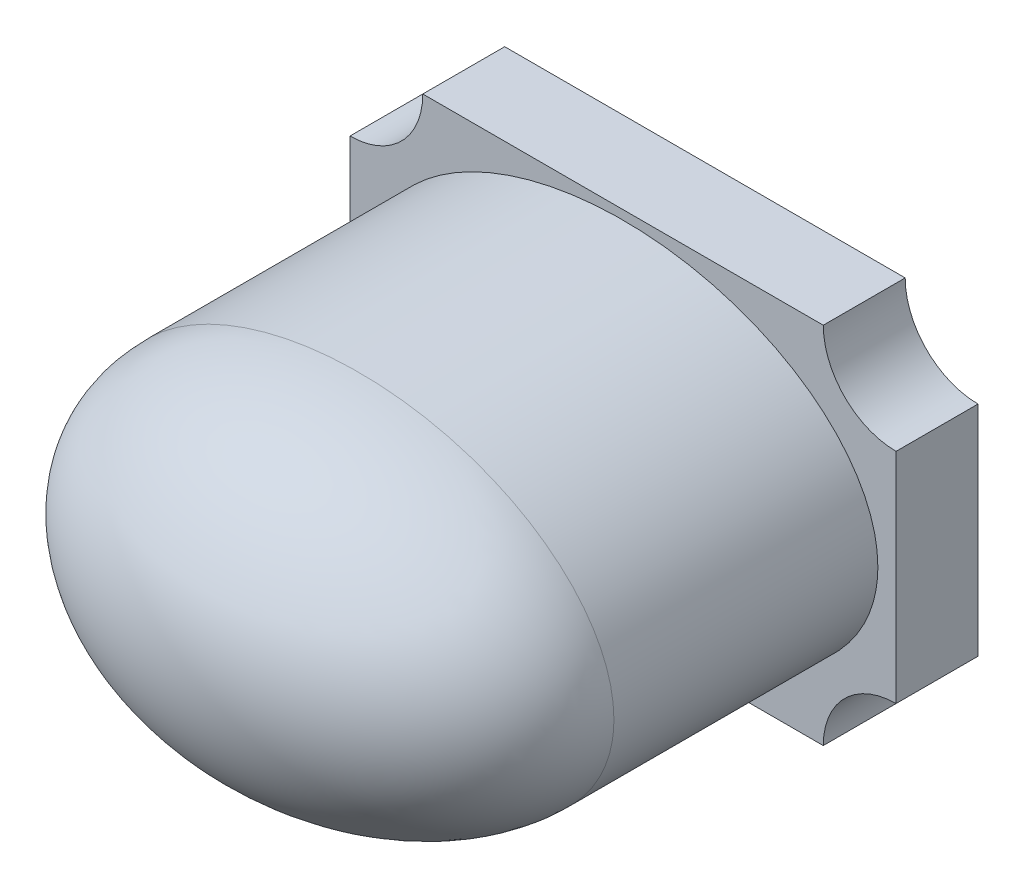
ISO-10303-21;
HEADER;
FILE_DESCRIPTION(('STEP AP214'),'2;1');
FILE_NAME('part.step','',(''),(''),'','','');
FILE_SCHEMA(('AUTOMOTIVE_DESIGN { 1 0 10303 214 1 1 1 1 }'));
ENDSEC;
DATA;
#1=APPLICATION_CONTEXT('core data for automotive mechanical design processes');
#2=APPLICATION_PROTOCOL_DEFINITION('international standard','automotive_design',2000,#1);
#3=PRODUCT_CONTEXT('',#1,'mechanical');
#4=PRODUCT('Part','Part','',(#3));
#5=PRODUCT_RELATED_PRODUCT_CATEGORY('part','',(#4));
#6=PRODUCT_DEFINITION_FORMATION('','',#4);
#7=PRODUCT_DEFINITION_CONTEXT('part definition',#1,'design');
#8=PRODUCT_DEFINITION('design','',#6,#7);
#9=PRODUCT_DEFINITION_SHAPE('','',#8);
#10=(LENGTH_UNIT() NAMED_UNIT(*) SI_UNIT(.MILLI.,.METRE.));
#11=(NAMED_UNIT(*) PLANE_ANGLE_UNIT() SI_UNIT($,.RADIAN.));
#12=(NAMED_UNIT(*) SI_UNIT($,.STERADIAN.) SOLID_ANGLE_UNIT());
#13=UNCERTAINTY_MEASURE_WITH_UNIT(LENGTH_MEASURE(1.E-05),#10,'distance_accuracy_value','');
#14=(GEOMETRIC_REPRESENTATION_CONTEXT(3) GLOBAL_UNCERTAINTY_ASSIGNED_CONTEXT((#13)) GLOBAL_UNIT_ASSIGNED_CONTEXT((#10,
#11,#12)) REPRESENTATION_CONTEXT('',''));
#15=CARTESIAN_POINT('',(0.,0.,0.));
#16=DIRECTION('',(0.,0.,1.));
#17=DIRECTION('',(1.,0.,0.));
#18=AXIS2_PLACEMENT_3D('',#15,#16,#17);
#19=CARTESIAN_POINT('',(1.5,0.,0.45));
#20=DIRECTION('',(1.,0.,0.));
#21=DIRECTION('',(0.,1.,0.));
#22=AXIS2_PLACEMENT_3D('',#19,#20,#21);
#23=PLANE('',#22);
#24=DIRECTION('',(0.,-1.,0.));
#25=VECTOR('',#24,1.);
#26=CARTESIAN_POINT('',(1.5,0.,0.));
#27=LINE('',#26,#25);
#28=CARTESIAN_POINT('',(1.5,0.600000000000001,0.));
#29=VERTEX_POINT('',#28);
#30=CARTESIAN_POINT('',(1.5,-0.600000000000001,0.));
#31=VERTEX_POINT('',#30);
#32=EDGE_CURVE('E138',#29,#31,#27,.T.);
#33=ORIENTED_EDGE('',*,*,#32,.F.);
#34=DIRECTION('',(0.,0.,-1.));
#35=VECTOR('',#34,1.);
#36=CARTESIAN_POINT('',(1.5,0.600000000000001,0.45));
#37=LINE('',#36,#35);
#38=CARTESIAN_POINT('',(1.5,0.600000000000001,0.45));
#39=VERTEX_POINT('',#38);
#40=EDGE_CURVE('E11',#39,#29,#37,.T.);
#41=ORIENTED_EDGE('',*,*,#40,.F.);
#42=DIRECTION('',(0.,-1.,0.));
#43=VECTOR('',#42,1.);
#44=CARTESIAN_POINT('',(1.5,0.,0.45));
#45=LINE('',#44,#43);
#46=CARTESIAN_POINT('',(1.5,-0.600000000000001,0.45));
#47=VERTEX_POINT('',#46);
#48=EDGE_CURVE('E157',#39,#47,#45,.T.);
#49=ORIENTED_EDGE('',*,*,#48,.T.);
#50=DIRECTION('',(0.,0.,-1.));
#51=VECTOR('',#50,1.);
#52=CARTESIAN_POINT('',(1.5,-0.600000000000001,0.45));
#53=LINE('',#52,#51);
#54=EDGE_CURVE('E91',#47,#31,#53,.T.);
#55=ORIENTED_EDGE('',*,*,#54,.T.);
#56=EDGE_LOOP('',(#33,#41,#49,#55));
#57=FACE_BOUND('',#56,.T.);
#58=ADVANCED_FACE('F37',(#57),#23,.T.);
#59=CARTESIAN_POINT('',(1.5,1.,0.45));
#60=DIRECTION('',(0.,0.,-1.));
#61=DIRECTION('',(-1.,0.,0.));
#62=AXIS2_PLACEMENT_3D('',#59,#60,#61);
#63=CYLINDRICAL_SURFACE('',#62,0.4);
#64=CARTESIAN_POINT('',(1.5,1.,0.));
#65=DIRECTION('',(0.,0.,1.));
#66=DIRECTION('',(1.,0.,0.));
#67=AXIS2_PLACEMENT_3D('',#64,#65,#66);
#68=CIRCLE('',#67,0.4);
#69=CARTESIAN_POINT('',(1.1,1.,0.));
#70=VERTEX_POINT('',#69);
#71=EDGE_CURVE('E141',#29,#70,#68,.F.);
#72=ORIENTED_EDGE('',*,*,#71,.T.);
#73=DIRECTION('',(0.,0.,-1.));
#74=VECTOR('',#73,1.);
#75=CARTESIAN_POINT('',(1.1,1.,0.45));
#76=LINE('',#75,#74);
#77=CARTESIAN_POINT('',(1.1,1.,0.45));
#78=VERTEX_POINT('',#77);
#79=EDGE_CURVE('E48',#78,#70,#76,.T.);
#80=ORIENTED_EDGE('',*,*,#79,.F.);
#81=CARTESIAN_POINT('',(1.5,1.,0.45));
#82=DIRECTION('',(0.,0.,1.));
#83=DIRECTION('',(1.,0.,0.));
#84=AXIS2_PLACEMENT_3D('',#81,#82,#83);
#85=CIRCLE('',#84,0.4);
#86=EDGE_CURVE('E184',#39,#78,#85,.F.);
#87=ORIENTED_EDGE('',*,*,#86,.F.);
#88=ORIENTED_EDGE('',*,*,#40,.T.);
#89=EDGE_LOOP('',(#72,#80,#87,#88));
#90=FACE_BOUND('',#89,.T.);
#91=ADVANCED_FACE('F218',(#90),#63,.F.);
#92=CARTESIAN_POINT('',(0.,1.,0.45));
#93=DIRECTION('',(0.,-1.,0.));
#94=DIRECTION('',(0.,0.,-1.));
#95=AXIS2_PLACEMENT_3D('',#92,#93,#94);
#96=PLANE('',#95);
#97=DIRECTION('',(-1.,0.,0.));
#98=VECTOR('',#97,1.);
#99=CARTESIAN_POINT('',(0.,1.,0.));
#100=LINE('',#99,#98);
#101=CARTESIAN_POINT('',(-1.1,1.,0.));
#102=VERTEX_POINT('',#101);
#103=EDGE_CURVE('E144',#70,#102,#100,.T.);
#104=ORIENTED_EDGE('',*,*,#103,.T.);
#105=DIRECTION('',(0.,0.,-1.));
#106=VECTOR('',#105,1.);
#107=CARTESIAN_POINT('',(-1.1,1.,0.45));
#108=LINE('',#107,#106);
#109=CARTESIAN_POINT('',(-1.1,1.,0.45));
#110=VERTEX_POINT('',#109);
#111=EDGE_CURVE('E163',#110,#102,#108,.T.);
#112=ORIENTED_EDGE('',*,*,#111,.F.);
#113=DIRECTION('',(-1.,0.,0.));
#114=VECTOR('',#113,1.);
#115=CARTESIAN_POINT('',(0.,1.,0.45));
#116=LINE('',#115,#114);
#117=EDGE_CURVE('E172',#78,#110,#116,.T.);
#118=ORIENTED_EDGE('',*,*,#117,.F.);
#119=ORIENTED_EDGE('',*,*,#79,.T.);
#120=EDGE_LOOP('',(#104,#112,#118,#119));
#121=FACE_BOUND('',#120,.T.);
#122=ADVANCED_FACE('F170',(#121),#96,.F.);
#123=CARTESIAN_POINT('',(-1.5,1.,0.45));
#124=DIRECTION('',(0.,0.,-1.));
#125=DIRECTION('',(-1.,0.,0.));
#126=AXIS2_PLACEMENT_3D('',#123,#124,#125);
#127=CYLINDRICAL_SURFACE('',#126,0.4);
#128=CARTESIAN_POINT('',(-1.5,1.,0.));
#129=DIRECTION('',(0.,0.,1.));
#130=DIRECTION('',(1.,0.,0.));
#131=AXIS2_PLACEMENT_3D('',#128,#129,#130);
#132=CIRCLE('',#131,0.4);
#133=CARTESIAN_POINT('',(-1.5,0.600000000000001,0.));
#134=VERTEX_POINT('',#133);
#135=EDGE_CURVE('E147',#134,#102,#132,.T.);
#136=ORIENTED_EDGE('',*,*,#135,.F.);
#137=DIRECTION('',(0.,0.,-1.));
#138=VECTOR('',#137,1.);
#139=CARTESIAN_POINT('',(-1.5,0.600000000000001,0.45));
#140=LINE('',#139,#138);
#141=CARTESIAN_POINT('',(-1.5,0.600000000000001,0.45));
#142=VERTEX_POINT('',#141);
#143=EDGE_CURVE('E161',#142,#134,#140,.T.);
#144=ORIENTED_EDGE('',*,*,#143,.F.);
#145=CARTESIAN_POINT('',(-1.5,1.,0.45));
#146=DIRECTION('',(0.,0.,1.));
#147=DIRECTION('',(1.,0.,0.));
#148=AXIS2_PLACEMENT_3D('',#145,#146,#147);
#149=CIRCLE('',#148,0.4);
#150=EDGE_CURVE('E182',#142,#110,#149,.T.);
#151=ORIENTED_EDGE('',*,*,#150,.T.);
#152=ORIENTED_EDGE('',*,*,#111,.T.);
#153=EDGE_LOOP('',(#136,#144,#151,#152));
#154=FACE_BOUND('',#153,.T.);
#155=ADVANCED_FACE('F180',(#154),#127,.F.);
#156=CARTESIAN_POINT('',(-1.5,0.,0.45));
#157=DIRECTION('',(1.,0.,0.));
#158=DIRECTION('',(0.,1.,0.));
#159=AXIS2_PLACEMENT_3D('',#156,#157,#158);
#160=PLANE('',#159);
#161=DIRECTION('',(0.,-1.,0.));
#162=VECTOR('',#161,1.);
#163=CARTESIAN_POINT('',(-1.5,0.,0.));
#164=LINE('',#163,#162);
#165=CARTESIAN_POINT('',(-1.5,-0.6,0.));
#166=VERTEX_POINT('',#165);
#167=EDGE_CURVE('E150',#134,#166,#164,.T.);
#168=ORIENTED_EDGE('',*,*,#167,.T.);
#169=DIRECTION('',(0.,0.,-1.));
#170=VECTOR('',#169,1.);
#171=CARTESIAN_POINT('',(-1.5,-0.6,0.45));
#172=LINE('',#171,#170);
#173=CARTESIAN_POINT('',(-1.5,-0.6,0.45));
#174=VERTEX_POINT('',#173);
#175=EDGE_CURVE('E130',#174,#166,#172,.T.);
#176=ORIENTED_EDGE('',*,*,#175,.F.);
#177=DIRECTION('',(0.,-1.,0.));
#178=VECTOR('',#177,1.);
#179=CARTESIAN_POINT('',(-1.5,0.,0.45));
#180=LINE('',#179,#178);
#181=EDGE_CURVE('E117',#142,#174,#180,.T.);
#182=ORIENTED_EDGE('',*,*,#181,.F.);
#183=ORIENTED_EDGE('',*,*,#143,.T.);
#184=EDGE_LOOP('',(#168,#176,#182,#183));
#185=FACE_BOUND('',#184,.T.);
#186=ADVANCED_FACE('F210',(#185),#160,.F.);
#187=CARTESIAN_POINT('',(-1.5,-1.,0.45));
#188=DIRECTION('',(0.,0.,-1.));
#189=DIRECTION('',(-1.,0.,0.));
#190=AXIS2_PLACEMENT_3D('',#187,#188,#189);
#191=CYLINDRICAL_SURFACE('',#190,0.4);
#192=CARTESIAN_POINT('',(-1.5,-1.,0.));
#193=DIRECTION('',(0.,0.,1.));
#194=DIRECTION('',(1.,0.,0.));
#195=AXIS2_PLACEMENT_3D('',#192,#193,#194);
#196=CIRCLE('',#195,0.4);
#197=CARTESIAN_POINT('',(-1.1,-1.,0.));
#198=VERTEX_POINT('',#197);
#199=EDGE_CURVE('E126',#166,#198,#196,.F.);
#200=ORIENTED_EDGE('',*,*,#199,.T.);
#201=DIRECTION('',(0.,0.,-1.));
#202=VECTOR('',#201,1.);
#203=CARTESIAN_POINT('',(-1.1,-1.,0.45));
#204=LINE('',#203,#202);
#205=CARTESIAN_POINT('',(-1.1,-1.,0.45));
#206=VERTEX_POINT('',#205);
#207=EDGE_CURVE('E123',#206,#198,#204,.T.);
#208=ORIENTED_EDGE('',*,*,#207,.F.);
#209=CARTESIAN_POINT('',(-1.5,-1.,0.45));
#210=DIRECTION('',(0.,0.,1.));
#211=DIRECTION('',(1.,0.,0.));
#212=AXIS2_PLACEMENT_3D('',#209,#210,#211);
#213=CIRCLE('',#212,0.4);
#214=EDGE_CURVE('E110',#174,#206,#213,.F.);
#215=ORIENTED_EDGE('',*,*,#214,.F.);
#216=ORIENTED_EDGE('',*,*,#175,.T.);
#217=EDGE_LOOP('',(#200,#208,#215,#216));
#218=FACE_BOUND('',#217,.T.);
#219=ADVANCED_FACE('F124',(#218),#191,.F.);
#220=CARTESIAN_POINT('',(0.,-1.,0.45));
#221=DIRECTION('',(0.,-1.,0.));
#222=DIRECTION('',(0.,0.,-1.));
#223=AXIS2_PLACEMENT_3D('',#220,#221,#222);
#224=PLANE('',#223);
#225=DIRECTION('',(-1.,0.,0.));
#226=VECTOR('',#225,1.);
#227=CARTESIAN_POINT('',(0.,-1.,0.));
#228=LINE('',#227,#226);
#229=CARTESIAN_POINT('',(1.1,-1.,0.));
#230=VERTEX_POINT('',#229);
#231=EDGE_CURVE('E153',#230,#198,#228,.T.);
#232=ORIENTED_EDGE('',*,*,#231,.F.);
#233=DIRECTION('',(0.,0.,-1.));
#234=VECTOR('',#233,1.);
#235=CARTESIAN_POINT('',(1.1,-1.,0.45));
#236=LINE('',#235,#234);
#237=CARTESIAN_POINT('',(1.1,-1.,0.45));
#238=VERTEX_POINT('',#237);
#239=EDGE_CURVE('E131',#238,#230,#236,.T.);
#240=ORIENTED_EDGE('',*,*,#239,.F.);
#241=DIRECTION('',(-1.,0.,0.));
#242=VECTOR('',#241,1.);
#243=CARTESIAN_POINT('',(0.,-1.,0.45));
#244=LINE('',#243,#242);
#245=EDGE_CURVE('E114',#238,#206,#244,.T.);
#246=ORIENTED_EDGE('',*,*,#245,.T.);
#247=ORIENTED_EDGE('',*,*,#207,.T.);
#248=EDGE_LOOP('',(#232,#240,#246,#247));
#249=FACE_BOUND('',#248,.T.);
#250=ADVANCED_FACE('F133',(#249),#224,.T.);
#251=CARTESIAN_POINT('',(1.5,-1.,0.45));
#252=DIRECTION('',(0.,0.,-1.));
#253=DIRECTION('',(-1.,0.,0.));
#254=AXIS2_PLACEMENT_3D('',#251,#252,#253);
#255=CYLINDRICAL_SURFACE('',#254,0.4);
#256=CARTESIAN_POINT('',(1.5,-1.,0.));
#257=DIRECTION('',(0.,0.,1.));
#258=DIRECTION('',(1.,0.,0.));
#259=AXIS2_PLACEMENT_3D('',#256,#257,#258);
#260=CIRCLE('',#259,0.4);
#261=EDGE_CURVE('E155',#230,#31,#260,.F.);
#262=ORIENTED_EDGE('',*,*,#261,.T.);
#263=ORIENTED_EDGE('',*,*,#54,.F.);
#264=CARTESIAN_POINT('',(1.5,-1.,0.45));
#265=DIRECTION('',(0.,0.,1.));
#266=DIRECTION('',(1.,0.,0.));
#267=AXIS2_PLACEMENT_3D('',#264,#265,#266);
#268=CIRCLE('',#267,0.4);
#269=EDGE_CURVE('E59',#238,#47,#268,.F.);
#270=ORIENTED_EDGE('',*,*,#269,.F.);
#271=ORIENTED_EDGE('',*,*,#239,.T.);
#272=EDGE_LOOP('',(#262,#263,#270,#271));
#273=FACE_BOUND('',#272,.T.);
#274=ADVANCED_FACE('F199',(#273),#255,.F.);
#275=CARTESIAN_POINT('',(0.,0.,0.45));
#276=DIRECTION('',(0.,0.,1.));
#277=DIRECTION('',(1.,0.,0.));
#278=AXIS2_PLACEMENT_3D('',#275,#276,#277);
#279=PLANE('',#278);
#280=CARTESIAN_POINT('',(0.,0.,0.45));
#281=DIRECTION('',(0.,0.,1.));
#282=DIRECTION('',(1.,0.,0.));
#283=AXIS2_PLACEMENT_3D('',#280,#281,#282);
#284=ELLIPSE('',#283,1.4,0.95);
#285=CARTESIAN_POINT('',(1.4,0.,0.45));
#286=VERTEX_POINT('',#285);
#287=EDGE_CURVE('E142',#286,#286,#284,.F.);
#288=ORIENTED_EDGE('',*,*,#287,.T.);
#289=EDGE_LOOP('',(#288));
#290=FACE_BOUND('',#289,.T.);
#291=ORIENTED_EDGE('',*,*,#48,.F.);
#292=ORIENTED_EDGE('',*,*,#86,.T.);
#293=ORIENTED_EDGE('',*,*,#117,.T.);
#294=ORIENTED_EDGE('',*,*,#150,.F.);
#295=ORIENTED_EDGE('',*,*,#181,.T.);
#296=ORIENTED_EDGE('',*,*,#214,.T.);
#297=ORIENTED_EDGE('',*,*,#245,.F.);
#298=ORIENTED_EDGE('',*,*,#269,.T.);
#299=EDGE_LOOP('',(#291,#292,#293,#294,#295,#296,#297,#298));
#300=FACE_BOUND('',#299,.T.);
#301=ADVANCED_FACE('F112',(#290,#300),#279,.T.);
#302=CARTESIAN_POINT('',(0.,0.,0.));
#303=DIRECTION('',(0.,0.,1.));
#304=DIRECTION('',(1.,0.,0.));
#305=AXIS2_PLACEMENT_3D('',#302,#303,#304);
#306=PLANE('',#305);
#307=ORIENTED_EDGE('',*,*,#32,.T.);
#308=ORIENTED_EDGE('',*,*,#261,.F.);
#309=ORIENTED_EDGE('',*,*,#231,.T.);
#310=ORIENTED_EDGE('',*,*,#199,.F.);
#311=ORIENTED_EDGE('',*,*,#167,.F.);
#312=ORIENTED_EDGE('',*,*,#135,.T.);
#313=ORIENTED_EDGE('',*,*,#103,.F.);
#314=ORIENTED_EDGE('',*,*,#71,.F.);
#315=EDGE_LOOP('',(#307,#308,#309,#310,#311,#312,#313,#314));
#316=FACE_BOUND('',#315,.T.);
#317=ADVANCED_FACE('F176',(#316),#306,.F.);
#318=CARTESIAN_POINT('',(0.,0.,1.9));
#319=DIRECTION('',(0.,0.,1.));
#320=DIRECTION('',(1.,0.,0.));
#321=AXIS2_PLACEMENT_3D('',#318,#319,#320);
#322=ELLIPSE('',#321,1.4,0.95);
#323=DIRECTION('',(0.,0.,-1.));
#324=VECTOR('',#323,1.);
#325=SURFACE_OF_LINEAR_EXTRUSION('',#322,#324);
#326=ORIENTED_EDGE('',*,*,#287,.F.);
#327=EDGE_LOOP('',(#326));
#328=FACE_BOUND('',#327,.T.);
#329=CARTESIAN_POINT('',(0.,0.,1.9));
#330=DIRECTION('',(0.,0.,1.));
#331=DIRECTION('',(1.,0.,0.));
#332=AXIS2_PLACEMENT_3D('',#329,#330,#331);
#333=ELLIPSE('',#332,1.4,0.95);
#334=CARTESIAN_POINT('',(1.4,0.,1.9));
#335=VERTEX_POINT('',#334);
#336=EDGE_CURVE('E43',#335,#335,#333,.T.);
#337=ORIENTED_EDGE('',*,*,#336,.F.);
#338=EDGE_LOOP('',(#337));
#339=FACE_BOUND('',#338,.T.);
#340=ADVANCED_FACE('F193',(#328,#339),#325,.F.);
#341=CARTESIAN_POINT('',(1.4,0.,1.9));
#342=CARTESIAN_POINT('',(1.4,0.,2.9));
#343=CARTESIAN_POINT('',(0.,0.,2.9));
#344=CARTESIAN_POINT('',(1.4,1.9,1.9));
#345=CARTESIAN_POINT('',(1.4,1.9,2.9));
#346=CARTESIAN_POINT('',(0.,0.,2.9));
#347=CARTESIAN_POINT('',(-1.4,1.9,1.9));
#348=CARTESIAN_POINT('',(-1.4,1.9,2.9));
#349=CARTESIAN_POINT('',(0.,0.,2.9));
#350=CARTESIAN_POINT('',(-1.4,0.,1.9));
#351=CARTESIAN_POINT('',(-1.4,0.,2.9));
#352=CARTESIAN_POINT('',(0.,0.,2.9));
#353=CARTESIAN_POINT('',(-1.4,-1.9,1.9));
#354=CARTESIAN_POINT('',(-1.4,-1.9,2.9));
#355=CARTESIAN_POINT('',(0.,0.,2.9));
#356=CARTESIAN_POINT('',(1.4,-1.9,1.9));
#357=CARTESIAN_POINT('',(1.4,-1.9,2.9));
#358=CARTESIAN_POINT('',(0.,0.,2.9));
#359=CARTESIAN_POINT('',(1.4,0.,1.9));
#360=CARTESIAN_POINT('',(1.4,0.,2.9));
#361=CARTESIAN_POINT('',(0.,0.,2.9));
#362=(BOUNDED_SURFACE() B_SPLINE_SURFACE(3,2,((#341,#342,#343),(#344,#345,#346),(#347,#348,
#349),(#350,#351,#352),(#353,#354,#355),(#356,#357,#358),(#359,#360,#361)),.UNSPECIFIED.,.T.,
.F.,.F.) B_SPLINE_SURFACE_WITH_KNOTS((4,3,4),(3,3),(0.,0.5,1.),(0.,1.),
.UNSPECIFIED.) GEOMETRIC_REPRESENTATION_ITEM() RATIONAL_B_SPLINE_SURFACE(((1.,0.707106781186548,
1.),(0.333333333333333,0.235702260395516,0.333333333333333),(0.333333333333333,
0.235702260395516,0.333333333333333),(1.,0.707106781186548,1.),(0.333333333333333,
0.235702260395516,0.333333333333333),(0.333333333333333,0.235702260395516,0.333333333333333),
(1.,0.707106781186548,1.))) REPRESENTATION_ITEM('') SURFACE());
#363=CARTESIAN_POINT('',(0.,0.,2.9));
#364=VERTEX_POINT('',#363);
#365=VERTEX_LOOP('',#364);
#366=FACE_BOUND('',#365,.T.);
#367=ORIENTED_EDGE('',*,*,#336,.T.);
#368=EDGE_LOOP('',(#367));
#369=FACE_BOUND('',#368,.T.);
#370=ADVANCED_FACE('F39',(#366,#369),#362,.T.);
#371=CLOSED_SHELL('',(#58,#91,#122,#155,#186,#219,#250,#274,#301,#317,#340,#370));
#372=MANIFOLD_SOLID_BREP('B2',#371);
#373=ADVANCED_BREP_SHAPE_REPRESENTATION('',(#18,#372),#14);
#374=SHAPE_DEFINITION_REPRESENTATION(#9,#373);
ENDSEC;
END-ISO-10303-21;
